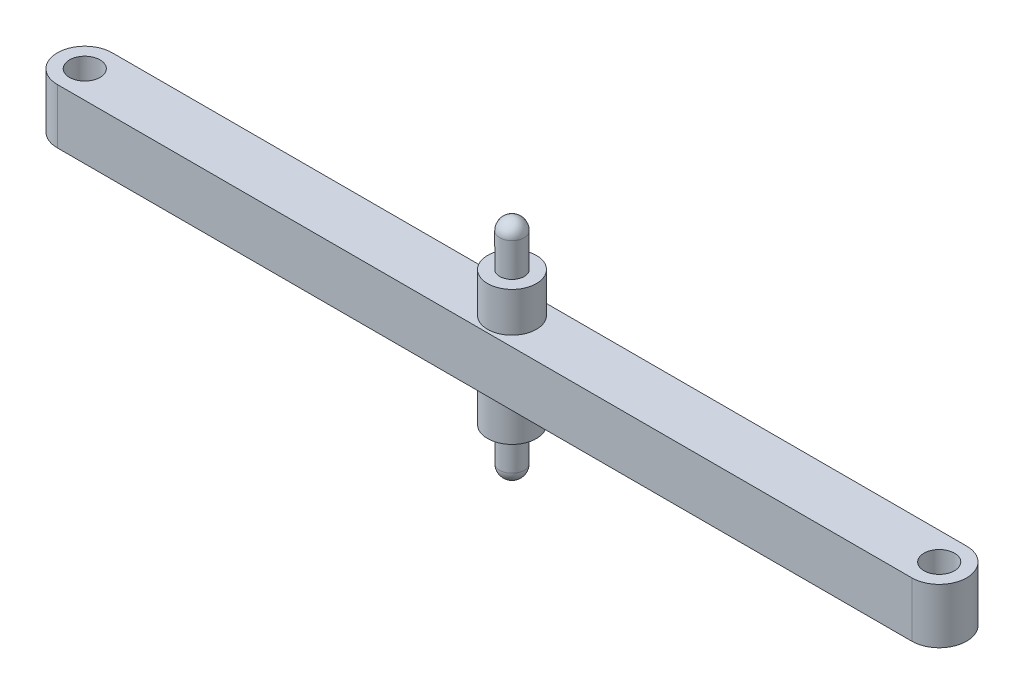
ISO-10303-21;
HEADER;
FILE_DESCRIPTION(('STEP AP214'),'2;1');
FILE_NAME('part.step','',(''),(''),'','','');
FILE_SCHEMA(('AUTOMOTIVE_DESIGN { 1 0 10303 214 1 1 1 1 }'));
ENDSEC;
DATA;
#1=APPLICATION_CONTEXT('core data for automotive mechanical design processes');
#2=APPLICATION_PROTOCOL_DEFINITION('international standard','automotive_design',2000,#1);
#3=PRODUCT_CONTEXT('',#1,'mechanical');
#4=PRODUCT('Part','Part','',(#3));
#5=PRODUCT_RELATED_PRODUCT_CATEGORY('part','',(#4));
#6=PRODUCT_DEFINITION_FORMATION('','',#4);
#7=PRODUCT_DEFINITION_CONTEXT('part definition',#1,'design');
#8=PRODUCT_DEFINITION('design','',#6,#7);
#9=PRODUCT_DEFINITION_SHAPE('','',#8);
#10=(LENGTH_UNIT() NAMED_UNIT(*) SI_UNIT(.MILLI.,.METRE.));
#11=(NAMED_UNIT(*) PLANE_ANGLE_UNIT() SI_UNIT($,.RADIAN.));
#12=(NAMED_UNIT(*) SI_UNIT($,.STERADIAN.) SOLID_ANGLE_UNIT());
#13=UNCERTAINTY_MEASURE_WITH_UNIT(LENGTH_MEASURE(1.E-05),#10,'distance_accuracy_value','');
#14=(GEOMETRIC_REPRESENTATION_CONTEXT(3) GLOBAL_UNCERTAINTY_ASSIGNED_CONTEXT((#13)) GLOBAL_UNIT_ASSIGNED_CONTEXT((#10,
#11,#12)) REPRESENTATION_CONTEXT('',''));
#15=CARTESIAN_POINT('',(0.,0.,0.));
#16=DIRECTION('',(0.,0.,1.));
#17=DIRECTION('',(1.,0.,0.));
#18=AXIS2_PLACEMENT_3D('',#15,#16,#17);
#19=CARTESIAN_POINT('',(-30.,-4.5,78.));
#20=DIRECTION('',(0.,1.,0.));
#21=DIRECTION('',(0.,0.,1.));
#22=AXIS2_PLACEMENT_3D('',#19,#20,#21);
#23=CYLINDRICAL_SURFACE('',#22,4.50000000000002);
#24=CARTESIAN_POINT('',(-30.,4.5,78.));
#25=DIRECTION('',(0.,1.,0.));
#26=DIRECTION('',(0.,0.,1.));
#27=AXIS2_PLACEMENT_3D('',#24,#25,#26);
#28=CIRCLE('',#27,4.50000000000002);
#29=CARTESIAN_POINT('',(-30.,4.5,73.5));
#30=VERTEX_POINT('',#29);
#31=CARTESIAN_POINT('',(-30.,4.5,82.5));
#32=VERTEX_POINT('',#31);
#33=EDGE_CURVE('E114',#30,#32,#28,.T.);
#34=ORIENTED_EDGE('',*,*,#33,.F.);
#35=DIRECTION('',(0.,1.,0.));
#36=VECTOR('',#35,1.);
#37=CARTESIAN_POINT('',(-30.,-4.5,73.5));
#38=LINE('',#37,#36);
#39=CARTESIAN_POINT('',(-30.,-4.5,73.5));
#40=VERTEX_POINT('',#39);
#41=EDGE_CURVE('E62',#40,#30,#38,.T.);
#42=ORIENTED_EDGE('',*,*,#41,.F.);
#43=CARTESIAN_POINT('',(-30.,-4.5,78.));
#44=DIRECTION('',(0.,1.,0.));
#45=DIRECTION('',(0.,0.,1.));
#46=AXIS2_PLACEMENT_3D('',#43,#44,#45);
#47=CIRCLE('',#46,4.50000000000002);
#48=CARTESIAN_POINT('',(-30.,-4.5,82.5));
#49=VERTEX_POINT('',#48);
#50=EDGE_CURVE('E107',#40,#49,#47,.T.);
#51=ORIENTED_EDGE('',*,*,#50,.T.);
#52=DIRECTION('',(0.,1.,0.));
#53=VECTOR('',#52,1.);
#54=CARTESIAN_POINT('',(-30.,-4.5,82.5));
#55=LINE('',#54,#53);
#56=EDGE_CURVE('E90',#49,#32,#55,.T.);
#57=ORIENTED_EDGE('',*,*,#56,.T.);
#58=EDGE_LOOP('',(#34,#42,#51,#57));
#59=FACE_BOUND('',#58,.T.);
#60=ADVANCED_FACE('F45',(#59),#23,.T.);
#61=CARTESIAN_POINT('',(110.,-4.5,73.5));
#62=DIRECTION('',(0.,0.,-1.));
#63=DIRECTION('',(-1.,0.,0.));
#64=AXIS2_PLACEMENT_3D('',#61,#62,#63);
#65=PLANE('',#64);
#66=DIRECTION('',(-1.,0.,0.));
#67=VECTOR('',#66,1.);
#68=CARTESIAN_POINT('',(110.,4.5,73.5));
#69=LINE('',#68,#67);
#70=CARTESIAN_POINT('',(110.,4.5,73.4999999999999));
#71=VERTEX_POINT('',#70);
#72=EDGE_CURVE('E109',#71,#30,#69,.T.);
#73=ORIENTED_EDGE('',*,*,#72,.F.);
#74=DIRECTION('',(0.,1.,0.));
#75=VECTOR('',#74,1.);
#76=CARTESIAN_POINT('',(110.,-4.5,73.4999999999999));
#77=LINE('',#76,#75);
#78=CARTESIAN_POINT('',(110.,-4.5,73.4999999999999));
#79=VERTEX_POINT('',#78);
#80=EDGE_CURVE('E79',#79,#71,#77,.T.);
#81=ORIENTED_EDGE('',*,*,#80,.F.);
#82=DIRECTION('',(-1.,0.,0.));
#83=VECTOR('',#82,1.);
#84=CARTESIAN_POINT('',(110.,-4.5,73.5));
#85=LINE('',#84,#83);
#86=EDGE_CURVE('E104',#79,#40,#85,.T.);
#87=ORIENTED_EDGE('',*,*,#86,.T.);
#88=ORIENTED_EDGE('',*,*,#41,.T.);
#89=EDGE_LOOP('',(#73,#81,#87,#88));
#90=FACE_BOUND('',#89,.T.);
#91=ADVANCED_FACE('F127',(#90),#65,.T.);
#92=CARTESIAN_POINT('',(110.,-4.5,77.9999999999999));
#93=DIRECTION('',(0.,1.,0.));
#94=DIRECTION('',(0.,0.,1.));
#95=AXIS2_PLACEMENT_3D('',#92,#93,#94);
#96=CYLINDRICAL_SURFACE('',#95,4.50000000000002);
#97=CARTESIAN_POINT('',(110.,4.5,77.9999999999999));
#98=DIRECTION('',(0.,1.,0.));
#99=DIRECTION('',(0.,0.,1.));
#100=AXIS2_PLACEMENT_3D('',#97,#98,#99);
#101=CIRCLE('',#100,4.50000000000002);
#102=CARTESIAN_POINT('',(110.,4.5,82.5));
#103=VERTEX_POINT('',#102);
#104=EDGE_CURVE('E98',#103,#71,#101,.T.);
#105=ORIENTED_EDGE('',*,*,#104,.F.);
#106=DIRECTION('',(0.,1.,0.));
#107=VECTOR('',#106,1.);
#108=CARTESIAN_POINT('',(110.,-4.5,82.5));
#109=LINE('',#108,#107);
#110=CARTESIAN_POINT('',(110.,-4.5,82.5));
#111=VERTEX_POINT('',#110);
#112=EDGE_CURVE('E93',#111,#103,#109,.T.);
#113=ORIENTED_EDGE('',*,*,#112,.F.);
#114=CARTESIAN_POINT('',(110.,-4.5,77.9999999999999));
#115=DIRECTION('',(0.,1.,0.));
#116=DIRECTION('',(0.,0.,1.));
#117=AXIS2_PLACEMENT_3D('',#114,#115,#116);
#118=CIRCLE('',#117,4.50000000000002);
#119=EDGE_CURVE('E96',#111,#79,#118,.T.);
#120=ORIENTED_EDGE('',*,*,#119,.T.);
#121=ORIENTED_EDGE('',*,*,#80,.T.);
#122=EDGE_LOOP('',(#105,#113,#120,#121));
#123=FACE_BOUND('',#122,.T.);
#124=ADVANCED_FACE('F95',(#123),#96,.T.);
#125=CARTESIAN_POINT('',(-30.,-4.5,82.5));
#126=DIRECTION('',(0.,0.,1.));
#127=DIRECTION('',(1.,0.,0.));
#128=AXIS2_PLACEMENT_3D('',#125,#126,#127);
#129=PLANE('',#128);
#130=DIRECTION('',(1.,0.,0.));
#131=VECTOR('',#130,1.);
#132=CARTESIAN_POINT('',(-30.,4.5,82.5));
#133=LINE('',#132,#131);
#134=EDGE_CURVE('E117',#32,#103,#133,.T.);
#135=ORIENTED_EDGE('',*,*,#134,.F.);
#136=ORIENTED_EDGE('',*,*,#56,.F.);
#137=DIRECTION('',(1.,0.,0.));
#138=VECTOR('',#137,1.);
#139=CARTESIAN_POINT('',(-30.,-4.5,82.5));
#140=LINE('',#139,#138);
#141=EDGE_CURVE('E103',#49,#111,#140,.T.);
#142=ORIENTED_EDGE('',*,*,#141,.T.);
#143=ORIENTED_EDGE('',*,*,#112,.T.);
#144=EDGE_LOOP('',(#135,#136,#142,#143));
#145=FACE_BOUND('',#144,.T.);
#146=ADVANCED_FACE('F106',(#145),#129,.T.);
#147=CARTESIAN_POINT('',(-30.,-4.5,78.));
#148=DIRECTION('',(0.,1.,0.));
#149=DIRECTION('',(0.,0.,1.));
#150=AXIS2_PLACEMENT_3D('',#147,#148,#149);
#151=PLANE('',#150);
#152=CARTESIAN_POINT('',(-30.,-4.5,78.));
#153=DIRECTION('',(0.,1.,0.));
#154=DIRECTION('',(0.,0.,1.));
#155=AXIS2_PLACEMENT_3D('',#152,#153,#154);
#156=CIRCLE('',#155,2.49999999999999);
#157=CARTESIAN_POINT('',(-30.,-4.5,80.5));
#158=VERTEX_POINT('',#157);
#159=EDGE_CURVE('E195',#158,#158,#156,.T.);
#160=ORIENTED_EDGE('',*,*,#159,.T.);
#161=EDGE_LOOP('',(#160));
#162=FACE_BOUND('',#161,.T.);
#163=CARTESIAN_POINT('',(110.,-4.5,77.9999999999999));
#164=DIRECTION('',(0.,1.,0.));
#165=DIRECTION('',(0.,0.,1.));
#166=AXIS2_PLACEMENT_3D('',#163,#164,#165);
#167=CIRCLE('',#166,2.49999999999999);
#168=CARTESIAN_POINT('',(110.,-4.5,80.4999999999999));
#169=VERTEX_POINT('',#168);
#170=EDGE_CURVE('E199',#169,#169,#167,.T.);
#171=ORIENTED_EDGE('',*,*,#170,.T.);
#172=EDGE_LOOP('',(#171));
#173=FACE_BOUND('',#172,.T.);
#174=CARTESIAN_POINT('',(40.,-4.5,78.));
#175=DIRECTION('',(0.,1.,0.));
#176=DIRECTION('',(0.,0.,1.));
#177=AXIS2_PLACEMENT_3D('',#174,#175,#176);
#178=CIRCLE('',#177,4.00000000000001);
#179=CARTESIAN_POINT('',(40.,-4.5,82.));
#180=VERTEX_POINT('',#179);
#181=EDGE_CURVE('E48',#180,#180,#178,.F.);
#182=ORIENTED_EDGE('',*,*,#181,.F.);
#183=EDGE_LOOP('',(#182));
#184=FACE_BOUND('',#183,.T.);
#185=ORIENTED_EDGE('',*,*,#50,.F.);
#186=ORIENTED_EDGE('',*,*,#86,.F.);
#187=ORIENTED_EDGE('',*,*,#119,.F.);
#188=ORIENTED_EDGE('',*,*,#141,.F.);
#189=EDGE_LOOP('',(#185,#186,#187,#188));
#190=FACE_BOUND('',#189,.T.);
#191=ADVANCED_FACE('F102',(#162,#173,#184,#190),#151,.F.);
#192=CARTESIAN_POINT('',(-30.,4.5,78.));
#193=DIRECTION('',(0.,1.,0.));
#194=DIRECTION('',(0.,0.,1.));
#195=AXIS2_PLACEMENT_3D('',#192,#193,#194);
#196=PLANE('',#195);
#197=CARTESIAN_POINT('',(-30.,4.5,78.));
#198=DIRECTION('',(0.,1.,0.));
#199=DIRECTION('',(0.,0.,1.));
#200=AXIS2_PLACEMENT_3D('',#197,#198,#199);
#201=CIRCLE('',#200,2.49999999999999);
#202=CARTESIAN_POINT('',(-30.,4.5,80.5));
#203=VERTEX_POINT('',#202);
#204=EDGE_CURVE('E193',#203,#203,#201,.T.);
#205=ORIENTED_EDGE('',*,*,#204,.F.);
#206=EDGE_LOOP('',(#205));
#207=FACE_BOUND('',#206,.T.);
#208=CARTESIAN_POINT('',(110.,4.5,77.9999999999999));
#209=DIRECTION('',(0.,1.,0.));
#210=DIRECTION('',(0.,0.,1.));
#211=AXIS2_PLACEMENT_3D('',#208,#209,#210);
#212=CIRCLE('',#211,2.49999999999999);
#213=CARTESIAN_POINT('',(110.,4.5,80.4999999999999));
#214=VERTEX_POINT('',#213);
#215=EDGE_CURVE('E196',#214,#214,#212,.T.);
#216=ORIENTED_EDGE('',*,*,#215,.F.);
#217=EDGE_LOOP('',(#216));
#218=FACE_BOUND('',#217,.T.);
#219=CARTESIAN_POINT('',(40.,4.5,78.));
#220=DIRECTION('',(0.,1.,0.));
#221=DIRECTION('',(0.,0.,1.));
#222=AXIS2_PLACEMENT_3D('',#219,#220,#221);
#223=CIRCLE('',#222,4.);
#224=CARTESIAN_POINT('',(40.,4.5,74.));
#225=VERTEX_POINT('',#224);
#226=EDGE_CURVE('E216',#225,#225,#223,.T.);
#227=ORIENTED_EDGE('',*,*,#226,.F.);
#228=EDGE_LOOP('',(#227));
#229=FACE_BOUND('',#228,.T.);
#230=ORIENTED_EDGE('',*,*,#33,.T.);
#231=ORIENTED_EDGE('',*,*,#134,.T.);
#232=ORIENTED_EDGE('',*,*,#104,.T.);
#233=ORIENTED_EDGE('',*,*,#72,.T.);
#234=EDGE_LOOP('',(#230,#231,#232,#233));
#235=FACE_BOUND('',#234,.T.);
#236=ADVANCED_FACE('F126',(#207,#218,#229,#235),#196,.T.);
#237=CARTESIAN_POINT('',(40.,11.,78.));
#238=DIRECTION('',(0.,-1.,0.));
#239=DIRECTION('',(0.,0.,-1.));
#240=AXIS2_PLACEMENT_3D('',#237,#238,#239);
#241=CYLINDRICAL_SURFACE('',#240,4.);
#242=CARTESIAN_POINT('',(40.,11.,78.));
#243=DIRECTION('',(0.,1.,0.));
#244=DIRECTION('',(0.,0.,1.));
#245=AXIS2_PLACEMENT_3D('',#242,#243,#244);
#246=CIRCLE('',#245,4.);
#247=CARTESIAN_POINT('',(40.,11.,74.));
#248=VERTEX_POINT('',#247);
#249=EDGE_CURVE('E118',#248,#248,#246,.T.);
#250=CARTESIAN_POINT('',(40.,11.,74.));
#251=CARTESIAN_POINT('',(40.,10.9322916666667,74.));
#252=CARTESIAN_POINT('',(40.,10.8645833333333,74.));
#253=CARTESIAN_POINT('',(40.,10.7291666666667,74.));
#254=CARTESIAN_POINT('',(40.,10.6614583333333,74.));
#255=CARTESIAN_POINT('',(40.,10.5260416666667,74.));
#256=CARTESIAN_POINT('',(40.,10.4583333333333,74.));
#257=CARTESIAN_POINT('',(40.,10.3229166666667,74.));
#258=CARTESIAN_POINT('',(40.,10.2552083333333,74.));
#259=CARTESIAN_POINT('',(40.,10.1197916666667,74.));
#260=CARTESIAN_POINT('',(40.,10.0520833333333,74.));
#261=CARTESIAN_POINT('',(40.,9.91666666666667,74.));
#262=CARTESIAN_POINT('',(40.,9.84895833333333,74.));
#263=CARTESIAN_POINT('',(40.,9.71354166666667,74.));
#264=CARTESIAN_POINT('',(40.,9.64583333333333,74.));
#265=CARTESIAN_POINT('',(40.,9.51041666666667,74.));
#266=CARTESIAN_POINT('',(40.,9.44270833333333,74.));
#267=CARTESIAN_POINT('',(40.,9.30729166666666,74.));
#268=CARTESIAN_POINT('',(40.,9.23958333333333,74.));
#269=CARTESIAN_POINT('',(40.,9.10416666666667,74.));
#270=CARTESIAN_POINT('',(40.,9.03645833333333,74.));
#271=CARTESIAN_POINT('',(40.,8.90104166666667,74.));
#272=CARTESIAN_POINT('',(40.,8.83333333333333,74.));
#273=CARTESIAN_POINT('',(40.,8.69791666666667,74.));
#274=CARTESIAN_POINT('',(40.,8.63020833333333,74.));
#275=CARTESIAN_POINT('',(40.,8.49479166666667,74.));
#276=CARTESIAN_POINT('',(40.,8.42708333333333,74.));
#277=CARTESIAN_POINT('',(40.,8.29166666666667,74.));
#278=CARTESIAN_POINT('',(40.,8.22395833333333,74.));
#279=CARTESIAN_POINT('',(40.,8.08854166666667,74.));
#280=CARTESIAN_POINT('',(40.,8.02083333333333,74.));
#281=CARTESIAN_POINT('',(40.,7.88541666666667,74.));
#282=CARTESIAN_POINT('',(40.,7.81770833333333,74.));
#283=CARTESIAN_POINT('',(40.,7.68229166666667,74.));
#284=CARTESIAN_POINT('',(40.,7.61458333333333,74.));
#285=CARTESIAN_POINT('',(40.,7.47916666666667,74.));
#286=CARTESIAN_POINT('',(40.,7.41145833333333,74.));
#287=CARTESIAN_POINT('',(40.,7.27604166666667,74.));
#288=CARTESIAN_POINT('',(40.,7.20833333333333,74.));
#289=CARTESIAN_POINT('',(40.,7.07291666666667,74.));
#290=CARTESIAN_POINT('',(40.,7.00520833333333,74.));
#291=CARTESIAN_POINT('',(40.,6.86979166666667,74.));
#292=CARTESIAN_POINT('',(40.,6.80208333333333,74.));
#293=CARTESIAN_POINT('',(40.,6.66666666666667,74.));
#294=CARTESIAN_POINT('',(40.,6.59895833333333,74.));
#295=CARTESIAN_POINT('',(40.,6.46354166666667,74.));
#296=CARTESIAN_POINT('',(40.,6.39583333333333,74.));
#297=CARTESIAN_POINT('',(40.,6.26041666666667,74.));
#298=CARTESIAN_POINT('',(40.,6.19270833333333,74.));
#299=CARTESIAN_POINT('',(40.,6.05729166666667,74.));
#300=CARTESIAN_POINT('',(40.,5.98958333333333,74.));
#301=CARTESIAN_POINT('',(40.,5.85416666666667,74.));
#302=CARTESIAN_POINT('',(40.,5.78645833333333,74.));
#303=CARTESIAN_POINT('',(40.,5.65104166666667,74.));
#304=CARTESIAN_POINT('',(40.,5.58333333333333,74.));
#305=CARTESIAN_POINT('',(40.,5.44791666666667,74.));
#306=CARTESIAN_POINT('',(40.,5.38020833333333,74.));
#307=CARTESIAN_POINT('',(40.,5.24479166666667,74.));
#308=CARTESIAN_POINT('',(40.,5.17708333333333,74.));
#309=CARTESIAN_POINT('',(40.,5.04166666666667,74.));
#310=CARTESIAN_POINT('',(40.,4.97395833333333,74.));
#311=CARTESIAN_POINT('',(40.,4.83854166666667,74.));
#312=CARTESIAN_POINT('',(40.,4.77083333333333,74.));
#313=CARTESIAN_POINT('',(40.,4.63541666666667,74.));
#314=CARTESIAN_POINT('',(40.,4.56770833333333,74.));
#315=CARTESIAN_POINT('',(40.,4.5,74.));
#316=B_SPLINE_CURVE_WITH_KNOTS('',3,(#250,#251,#252,#253,#254,#255,#256,#257,#258,#259,#260,
#261,#262,#263,#264,#265,#266,#267,#268,#269,#270,#271,#272,#273,#274,#275,#276,#277,#278,#279,
#280,#281,#282,#283,#284,#285,#286,#287,#288,#289,#290,#291,#292,#293,#294,#295,#296,#297,#298,
#299,#300,#301,#302,#303,#304,#305,#306,#307,#308,#309,#310,#311,#312,#313,#314,#315),
.UNSPECIFIED.,.F.,.F.,(4,2,2,2,2,2,2,2,2,2,2,2,2,2,2,2,2,2,2,2,2,2,2,2,2,2,2,2,2,2,2,2,4),(0.,
0.203124999999998,0.406249999999999,0.609374999999999,0.812499999999999,1.015625,1.21875,
1.421875,1.625,1.828125,2.03125,2.234375,2.4375,2.640625,2.84375,3.046875,3.25,3.453125,3.65625,
3.859375,4.0625,4.265625,4.46875,4.671875,4.875,5.078125,5.28125,5.484375,5.6875,5.890625,
6.09375,6.296875,6.5),.UNSPECIFIED.);
#317=EDGE_CURVE('BSEAM147',#248,#225,#316,.T.);
#318=ORIENTED_EDGE('',*,*,#249,.F.);
#319=ORIENTED_EDGE('',*,*,#226,.T.);
#320=ORIENTED_EDGE('',*,*,#317,.T.);
#321=ORIENTED_EDGE('',*,*,#317,.F.);
#322=EDGE_LOOP('',(#318,#320,#319,#321));
#323=FACE_BOUND('',#322,.T.);
#324=ADVANCED_FACE('F147',(#323),#241,.T.);
#325=CARTESIAN_POINT('',(40.,11.,78.));
#326=DIRECTION('',(0.,1.,0.));
#327=DIRECTION('',(0.,0.,1.));
#328=AXIS2_PLACEMENT_3D('',#325,#326,#327);
#329=PLANE('',#328);
#330=CARTESIAN_POINT('',(40.,11.,78.));
#331=DIRECTION('',(0.,1.,0.));
#332=DIRECTION('',(0.,0.,1.));
#333=AXIS2_PLACEMENT_3D('',#330,#331,#332);
#334=CIRCLE('',#333,2.);
#335=CARTESIAN_POINT('',(40.,11.,80.));
#336=VERTEX_POINT('',#335);
#337=EDGE_CURVE('E124',#336,#336,#334,.T.);
#338=ORIENTED_EDGE('',*,*,#337,.F.);
#339=EDGE_LOOP('',(#338));
#340=FACE_BOUND('',#339,.T.);
#341=ORIENTED_EDGE('',*,*,#249,.T.);
#342=EDGE_LOOP('',(#341));
#343=FACE_BOUND('',#342,.T.);
#344=ADVANCED_FACE('F153',(#340,#343),#329,.T.);
#345=CARTESIAN_POINT('',(40.,102.021975368589,78.));
#346=DIRECTION('',(0.,-1.,0.));
#347=DIRECTION('',(0.,0.,-1.));
#348=AXIS2_PLACEMENT_3D('',#345,#346,#347);
#349=CYLINDRICAL_SURFACE('',#348,2.);
#350=ORIENTED_EDGE('',*,*,#337,.T.);
#351=EDGE_LOOP('',(#350));
#352=FACE_BOUND('',#351,.T.);
#353=CARTESIAN_POINT('',(40.,16.5,78.));
#354=DIRECTION('',(0.,-1.,0.));
#355=DIRECTION('',(0.,0.,-1.));
#356=AXIS2_PLACEMENT_3D('',#353,#354,#355);
#357=CIRCLE('',#356,2.);
#358=CARTESIAN_POINT('',(40.,16.5,76.));
#359=VERTEX_POINT('',#358);
#360=EDGE_CURVE('E212',#359,#359,#357,.F.);
#361=ORIENTED_EDGE('',*,*,#360,.F.);
#362=EDGE_LOOP('',(#361));
#363=FACE_BOUND('',#362,.T.);
#364=ADVANCED_FACE('F157',(#352,#363),#349,.T.);
#365=CARTESIAN_POINT('',(40.,16.5,78.));
#366=DIRECTION('',(0.,1.,0.));
#367=DIRECTION('',(1.,0.,0.));
#368=AXIS2_PLACEMENT_3D('',#365,#366,#367);
#369=SPHERICAL_SURFACE('',#368,2.);
#370=ORIENTED_EDGE('',*,*,#360,.T.);
#371=EDGE_LOOP('',(#370));
#372=FACE_BOUND('',#371,.T.);
#373=ADVANCED_FACE('F159',(#372),#369,.T.);
#374=CARTESIAN_POINT('',(40.,-11.,78.));
#375=DIRECTION('',(0.,1.,0.));
#376=DIRECTION('',(0.,0.,1.));
#377=AXIS2_PLACEMENT_3D('',#374,#375,#376);
#378=CYLINDRICAL_SURFACE('',#377,4.00000000000001);
#379=CARTESIAN_POINT('',(40.,-11.,78.));
#380=DIRECTION('',(0.,-1.,0.));
#381=DIRECTION('',(0.,0.,-1.));
#382=AXIS2_PLACEMENT_3D('',#379,#380,#381);
#383=CIRCLE('',#382,4.00000000000001);
#384=CARTESIAN_POINT('',(40.,-11.,82.));
#385=VERTEX_POINT('',#384);
#386=EDGE_CURVE('E208',#385,#385,#383,.T.);
#387=CARTESIAN_POINT('',(40.,-11.,82.));
#388=CARTESIAN_POINT('',(40.,-10.9322916666667,82.));
#389=CARTESIAN_POINT('',(40.,-10.8645833333333,82.));
#390=CARTESIAN_POINT('',(40.,-10.7291666666667,82.));
#391=CARTESIAN_POINT('',(40.,-10.6614583333333,82.));
#392=CARTESIAN_POINT('',(40.,-10.5260416666667,82.));
#393=CARTESIAN_POINT('',(40.,-10.4583333333333,82.));
#394=CARTESIAN_POINT('',(40.,-10.3229166666667,82.));
#395=CARTESIAN_POINT('',(40.,-10.2552083333333,82.));
#396=CARTESIAN_POINT('',(40.,-10.1197916666667,82.));
#397=CARTESIAN_POINT('',(40.,-10.0520833333333,82.));
#398=CARTESIAN_POINT('',(40.,-9.91666666666666,82.));
#399=CARTESIAN_POINT('',(40.,-9.84895833333333,82.));
#400=CARTESIAN_POINT('',(40.,-9.71354166666666,82.));
#401=CARTESIAN_POINT('',(40.,-9.64583333333333,82.));
#402=CARTESIAN_POINT('',(40.,-9.51041666666666,82.));
#403=CARTESIAN_POINT('',(40.,-9.44270833333333,82.));
#404=CARTESIAN_POINT('',(40.,-9.30729166666666,82.));
#405=CARTESIAN_POINT('',(40.,-9.23958333333333,82.));
#406=CARTESIAN_POINT('',(40.,-9.10416666666666,82.));
#407=CARTESIAN_POINT('',(40.,-9.03645833333333,82.));
#408=CARTESIAN_POINT('',(40.,-8.90104166666666,82.));
#409=CARTESIAN_POINT('',(40.,-8.83333333333333,82.));
#410=CARTESIAN_POINT('',(40.,-8.69791666666666,82.));
#411=CARTESIAN_POINT('',(40.,-8.63020833333333,82.));
#412=CARTESIAN_POINT('',(40.,-8.49479166666666,82.));
#413=CARTESIAN_POINT('',(40.,-8.42708333333333,82.));
#414=CARTESIAN_POINT('',(40.,-8.29166666666666,82.));
#415=CARTESIAN_POINT('',(40.,-8.22395833333333,82.));
#416=CARTESIAN_POINT('',(40.,-8.08854166666666,82.));
#417=CARTESIAN_POINT('',(40.,-8.02083333333333,82.));
#418=CARTESIAN_POINT('',(40.,-7.88541666666667,82.));
#419=CARTESIAN_POINT('',(40.,-7.81770833333333,82.));
#420=CARTESIAN_POINT('',(40.,-7.68229166666666,82.));
#421=CARTESIAN_POINT('',(40.,-7.61458333333333,82.));
#422=CARTESIAN_POINT('',(40.,-7.47916666666666,82.));
#423=CARTESIAN_POINT('',(40.,-7.41145833333333,82.));
#424=CARTESIAN_POINT('',(40.,-7.27604166666666,82.));
#425=CARTESIAN_POINT('',(40.,-7.20833333333333,82.));
#426=CARTESIAN_POINT('',(40.,-7.07291666666666,82.));
#427=CARTESIAN_POINT('',(40.,-7.00520833333333,82.));
#428=CARTESIAN_POINT('',(40.,-6.86979166666666,82.));
#429=CARTESIAN_POINT('',(40.,-6.80208333333333,82.));
#430=CARTESIAN_POINT('',(40.,-6.66666666666666,82.));
#431=CARTESIAN_POINT('',(40.,-6.59895833333333,82.));
#432=CARTESIAN_POINT('',(40.,-6.46354166666666,82.));
#433=CARTESIAN_POINT('',(40.,-6.39583333333333,82.));
#434=CARTESIAN_POINT('',(40.,-6.26041666666666,82.));
#435=CARTESIAN_POINT('',(40.,-6.19270833333333,82.));
#436=CARTESIAN_POINT('',(40.,-6.05729166666666,82.));
#437=CARTESIAN_POINT('',(40.,-5.98958333333333,82.));
#438=CARTESIAN_POINT('',(40.,-5.85416666666666,82.));
#439=CARTESIAN_POINT('',(40.,-5.78645833333333,82.));
#440=CARTESIAN_POINT('',(40.,-5.65104166666666,82.));
#441=CARTESIAN_POINT('',(40.,-5.58333333333333,82.));
#442=CARTESIAN_POINT('',(40.,-5.44791666666666,82.));
#443=CARTESIAN_POINT('',(40.,-5.38020833333333,82.));
#444=CARTESIAN_POINT('',(40.,-5.24479166666666,82.));
#445=CARTESIAN_POINT('',(40.,-5.17708333333333,82.));
#446=CARTESIAN_POINT('',(40.,-5.04166666666667,82.));
#447=CARTESIAN_POINT('',(40.,-4.97395833333333,82.));
#448=CARTESIAN_POINT('',(40.,-4.83854166666666,82.));
#449=CARTESIAN_POINT('',(40.,-4.77083333333333,82.));
#450=CARTESIAN_POINT('',(40.,-4.63541666666666,82.));
#451=CARTESIAN_POINT('',(40.,-4.56770833333333,82.));
#452=CARTESIAN_POINT('',(40.,-4.5,82.));
#453=B_SPLINE_CURVE_WITH_KNOTS('',3,(#387,#388,#389,#390,#391,#392,#393,#394,#395,#396,#397,
#398,#399,#400,#401,#402,#403,#404,#405,#406,#407,#408,#409,#410,#411,#412,#413,#414,#415,#416,
#417,#418,#419,#420,#421,#422,#423,#424,#425,#426,#427,#428,#429,#430,#431,#432,#433,#434,#435,
#436,#437,#438,#439,#440,#441,#442,#443,#444,#445,#446,#447,#448,#449,#450,#451,#452),
.UNSPECIFIED.,.F.,.F.,(4,2,2,2,2,2,2,2,2,2,2,2,2,2,2,2,2,2,2,2,2,2,2,2,2,2,2,2,2,2,2,2,4),(0.,
0.203124999999998,0.406249999999999,0.609374999999999,0.812499999999999,1.015625,1.21875,
1.421875,1.625,1.828125,2.03125,2.234375,2.4375,2.640625,2.84375,3.046875,3.25,3.453125,3.65625,
3.859375,4.0625,4.265625,4.46875,4.671875,4.875,5.078125,5.28125,5.484375,5.6875,5.890625,
6.09375,6.296875,6.5),.UNSPECIFIED.);
#454=EDGE_CURVE('BSEAM162',#385,#180,#453,.T.);
#455=ORIENTED_EDGE('',*,*,#386,.F.);
#456=ORIENTED_EDGE('',*,*,#181,.T.);
#457=ORIENTED_EDGE('',*,*,#454,.T.);
#458=ORIENTED_EDGE('',*,*,#454,.F.);
#459=EDGE_LOOP('',(#455,#457,#456,#458));
#460=FACE_BOUND('',#459,.T.);
#461=ADVANCED_FACE('F162',(#460),#378,.T.);
#462=CARTESIAN_POINT('',(40.,-11.,78.));
#463=DIRECTION('',(0.,-1.,0.));
#464=DIRECTION('',(0.,0.,-1.));
#465=AXIS2_PLACEMENT_3D('',#462,#463,#464);
#466=PLANE('',#465);
#467=CARTESIAN_POINT('',(40.,-11.,78.));
#468=DIRECTION('',(0.,-1.,0.));
#469=DIRECTION('',(0.,0.,-1.));
#470=AXIS2_PLACEMENT_3D('',#467,#468,#469);
#471=CIRCLE('',#470,2.);
#472=CARTESIAN_POINT('',(40.,-11.,76.));
#473=VERTEX_POINT('',#472);
#474=EDGE_CURVE('E11',#473,#473,#471,.T.);
#475=ORIENTED_EDGE('',*,*,#474,.F.);
#476=EDGE_LOOP('',(#475));
#477=FACE_BOUND('',#476,.T.);
#478=ORIENTED_EDGE('',*,*,#386,.T.);
#479=EDGE_LOOP('',(#478));
#480=FACE_BOUND('',#479,.T.);
#481=ADVANCED_FACE('F169',(#477,#480),#466,.T.);
#482=CARTESIAN_POINT('',(40.,-102.021975368589,78.));
#483=DIRECTION('',(0.,1.,0.));
#484=DIRECTION('',(0.,0.,1.));
#485=AXIS2_PLACEMENT_3D('',#482,#483,#484);
#486=CYLINDRICAL_SURFACE('',#485,2.);
#487=ORIENTED_EDGE('',*,*,#474,.T.);
#488=EDGE_LOOP('',(#487));
#489=FACE_BOUND('',#488,.T.);
#490=CARTESIAN_POINT('',(40.,-16.5,78.));
#491=DIRECTION('',(0.,1.,0.));
#492=DIRECTION('',(0.,0.,1.));
#493=AXIS2_PLACEMENT_3D('',#490,#491,#492);
#494=CIRCLE('',#493,2.);
#495=CARTESIAN_POINT('',(40.,-16.5,80.));
#496=VERTEX_POINT('',#495);
#497=EDGE_CURVE('E205',#496,#496,#494,.F.);
#498=ORIENTED_EDGE('',*,*,#497,.F.);
#499=EDGE_LOOP('',(#498));
#500=FACE_BOUND('',#499,.T.);
#501=ADVANCED_FACE('F173',(#489,#500),#486,.T.);
#502=CARTESIAN_POINT('',(40.,-16.5,78.));
#503=DIRECTION('',(0.,1.,0.));
#504=DIRECTION('',(1.,0.,0.));
#505=AXIS2_PLACEMENT_3D('',#502,#503,#504);
#506=SPHERICAL_SURFACE('',#505,2.);
#507=ORIENTED_EDGE('',*,*,#497,.T.);
#508=EDGE_LOOP('',(#507));
#509=FACE_BOUND('',#508,.T.);
#510=ADVANCED_FACE('F175',(#509),#506,.T.);
#511=CARTESIAN_POINT('',(110.,4.5,77.9999999999999));
#512=DIRECTION('',(0.,1.,0.));
#513=DIRECTION('',(0.,0.,1.));
#514=AXIS2_PLACEMENT_3D('',#511,#512,#513);
#515=CYLINDRICAL_SURFACE('',#514,2.49999999999999);
#516=ORIENTED_EDGE('',*,*,#215,.T.);
#517=EDGE_LOOP('',(#516));
#518=FACE_BOUND('',#517,.T.);
#519=ORIENTED_EDGE('',*,*,#170,.F.);
#520=EDGE_LOOP('',(#519));
#521=FACE_BOUND('',#520,.T.);
#522=ADVANCED_FACE('F177',(#518,#521),#515,.F.);
#523=CARTESIAN_POINT('',(-30.,4.5,78.));
#524=DIRECTION('',(0.,1.,0.));
#525=DIRECTION('',(0.,0.,1.));
#526=AXIS2_PLACEMENT_3D('',#523,#524,#525);
#527=CYLINDRICAL_SURFACE('',#526,2.49999999999999);
#528=ORIENTED_EDGE('',*,*,#204,.T.);
#529=EDGE_LOOP('',(#528));
#530=FACE_BOUND('',#529,.T.);
#531=ORIENTED_EDGE('',*,*,#159,.F.);
#532=EDGE_LOOP('',(#531));
#533=FACE_BOUND('',#532,.T.);
#534=ADVANCED_FACE('F184',(#530,#533),#527,.F.);
#535=CLOSED_SHELL('',(#60,#91,#124,#146,#191,#236,#324,#344,#364,#373,#461,#481,#501,#510,#522,#534));
#536=MANIFOLD_SOLID_BREP('B2',#535);
#537=ADVANCED_BREP_SHAPE_REPRESENTATION('',(#18,#536),#14);
#538=SHAPE_DEFINITION_REPRESENTATION(#9,#537);
ENDSEC;
END-ISO-10303-21;
